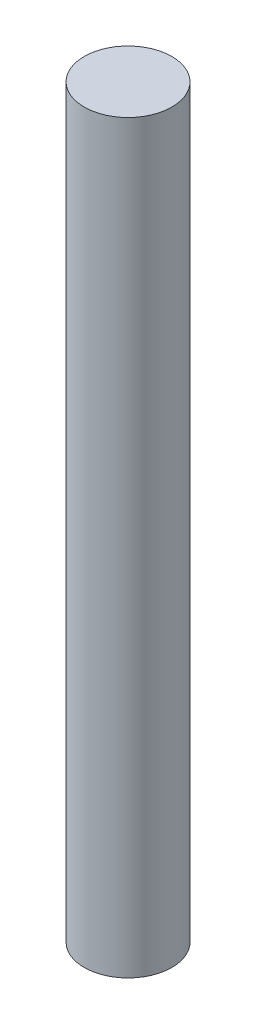
ISO-10303-21;
HEADER;
FILE_DESCRIPTION(('STEP AP214'),'2;1');
FILE_NAME('part.step','',(''),(''),'','','');
FILE_SCHEMA(('AUTOMOTIVE_DESIGN { 1 0 10303 214 1 1 1 1 }'));
ENDSEC;
DATA;
#1=APPLICATION_CONTEXT('core data for automotive mechanical design processes');
#2=APPLICATION_PROTOCOL_DEFINITION('international standard','automotive_design',2000,#1);
#3=PRODUCT_CONTEXT('',#1,'mechanical');
#4=PRODUCT('Part','Part','',(#3));
#5=PRODUCT_RELATED_PRODUCT_CATEGORY('part','',(#4));
#6=PRODUCT_DEFINITION_FORMATION('','',#4);
#7=PRODUCT_DEFINITION_CONTEXT('part definition',#1,'design');
#8=PRODUCT_DEFINITION('design','',#6,#7);
#9=PRODUCT_DEFINITION_SHAPE('','',#8);
#10=(LENGTH_UNIT() NAMED_UNIT(*) SI_UNIT(.MILLI.,.METRE.));
#11=(NAMED_UNIT(*) PLANE_ANGLE_UNIT() SI_UNIT($,.RADIAN.));
#12=(NAMED_UNIT(*) SI_UNIT($,.STERADIAN.) SOLID_ANGLE_UNIT());
#13=UNCERTAINTY_MEASURE_WITH_UNIT(LENGTH_MEASURE(1.E-05),#10,'distance_accuracy_value','');
#14=(GEOMETRIC_REPRESENTATION_CONTEXT(3) GLOBAL_UNCERTAINTY_ASSIGNED_CONTEXT((#13)) GLOBAL_UNIT_ASSIGNED_CONTEXT((#10,
#11,#12)) REPRESENTATION_CONTEXT('',''));
#15=CARTESIAN_POINT('',(0.,0.,0.));
#16=DIRECTION('',(0.,0.,1.));
#17=DIRECTION('',(1.,0.,0.));
#18=AXIS2_PLACEMENT_3D('',#15,#16,#17);
#19=CARTESIAN_POINT('',(0.,17.,0.));
#20=DIRECTION('',(0.,-1.,0.));
#21=DIRECTION('',(0.,0.,1.));
#22=AXIS2_PLACEMENT_3D('',#19,#20,#21);
#23=CYLINDRICAL_SURFACE('',#22,2.);
#24=CARTESIAN_POINT('',(0.,17.,0.));
#25=DIRECTION('',(0.,-1.,0.));
#26=DIRECTION('',(0.,0.,-1.));
#27=AXIS2_PLACEMENT_3D('',#24,#25,#26);
#28=CIRCLE('',#27,2.);
#29=CARTESIAN_POINT('',(0.,17.,-2.));
#30=VERTEX_POINT('',#29);
#31=EDGE_CURVE('E10',#30,#30,#28,.T.);
#32=ORIENTED_EDGE('',*,*,#31,.T.);
#33=EDGE_LOOP('',(#32));
#34=FACE_BOUND('',#33,.T.);
#35=CARTESIAN_POINT('',(0.,-17.,0.));
#36=DIRECTION('',(0.,-1.,0.));
#37=DIRECTION('',(0.,0.,-1.));
#38=AXIS2_PLACEMENT_3D('',#35,#36,#37);
#39=CIRCLE('',#38,2.);
#40=CARTESIAN_POINT('',(0.,-17.,-2.));
#41=VERTEX_POINT('',#40);
#42=EDGE_CURVE('E40',#41,#41,#39,.T.);
#43=ORIENTED_EDGE('',*,*,#42,.F.);
#44=EDGE_LOOP('',(#43));
#45=FACE_BOUND('',#44,.T.);
#46=ADVANCED_FACE('F37',(#34,#45),#23,.T.);
#47=CARTESIAN_POINT('',(0.,17.,0.));
#48=DIRECTION('',(0.,1.,0.));
#49=DIRECTION('',(0.,0.,-1.));
#50=AXIS2_PLACEMENT_3D('',#47,#48,#49);
#51=PLANE('',#50);
#52=ORIENTED_EDGE('',*,*,#31,.F.);
#53=EDGE_LOOP('',(#52));
#54=FACE_BOUND('',#53,.T.);
#55=ADVANCED_FACE('F52',(#54),#51,.T.);
#56=CARTESIAN_POINT('',(0.,-17.,0.));
#57=DIRECTION('',(0.,1.,0.));
#58=DIRECTION('',(0.,0.,-1.));
#59=AXIS2_PLACEMENT_3D('',#56,#57,#58);
#60=PLANE('',#59);
#61=ORIENTED_EDGE('',*,*,#42,.T.);
#62=EDGE_LOOP('',(#61));
#63=FACE_BOUND('',#62,.T.);
#64=ADVANCED_FACE('F49',(#63),#60,.F.);
#65=CLOSED_SHELL('',(#46,#55,#64));
#66=MANIFOLD_SOLID_BREP('B2',#65);
#67=ADVANCED_BREP_SHAPE_REPRESENTATION('',(#18,#66),#14);
#68=SHAPE_DEFINITION_REPRESENTATION(#9,#67);
ENDSEC;
END-ISO-10303-21;
